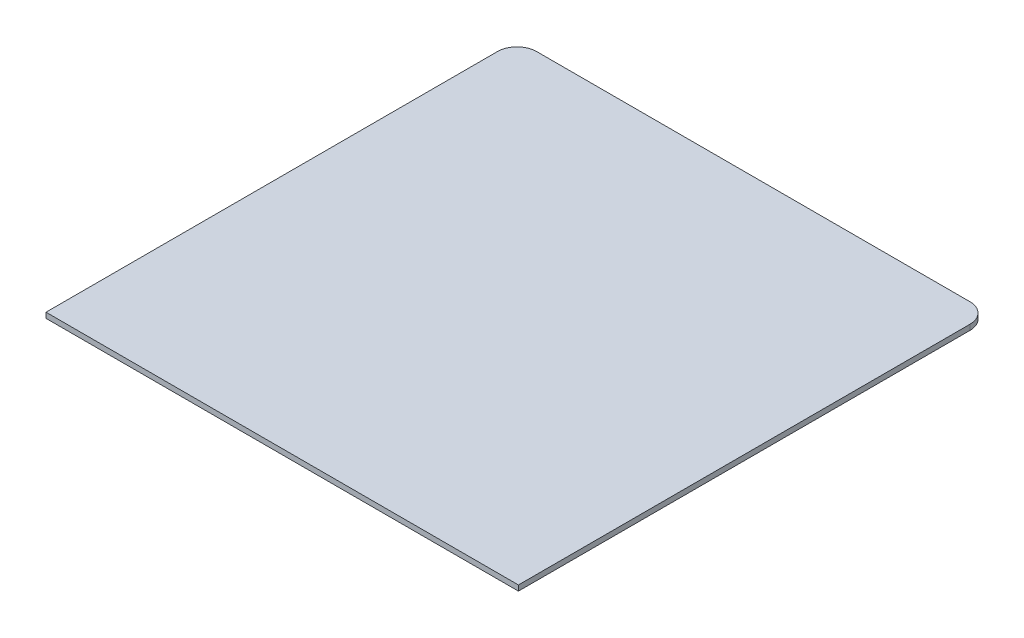
ISO-10303-21;
HEADER;
FILE_DESCRIPTION(('STEP AP214'),'2;1');
FILE_NAME('part.step','',(''),(''),'','','');
FILE_SCHEMA(('AUTOMOTIVE_DESIGN { 1 0 10303 214 1 1 1 1 }'));
ENDSEC;
DATA;
#1=APPLICATION_CONTEXT('core data for automotive mechanical design processes');
#2=APPLICATION_PROTOCOL_DEFINITION('international standard','automotive_design',2000,#1);
#3=PRODUCT_CONTEXT('',#1,'mechanical');
#4=PRODUCT('Part','Part','',(#3));
#5=PRODUCT_RELATED_PRODUCT_CATEGORY('part','',(#4));
#6=PRODUCT_DEFINITION_FORMATION('','',#4);
#7=PRODUCT_DEFINITION_CONTEXT('part definition',#1,'design');
#8=PRODUCT_DEFINITION('design','',#6,#7);
#9=PRODUCT_DEFINITION_SHAPE('','',#8);
#10=(LENGTH_UNIT() NAMED_UNIT(*) SI_UNIT(.MILLI.,.METRE.));
#11=(NAMED_UNIT(*) PLANE_ANGLE_UNIT() SI_UNIT($,.RADIAN.));
#12=(NAMED_UNIT(*) SI_UNIT($,.STERADIAN.) SOLID_ANGLE_UNIT());
#13=UNCERTAINTY_MEASURE_WITH_UNIT(LENGTH_MEASURE(1.E-05),#10,'distance_accuracy_value','');
#14=(GEOMETRIC_REPRESENTATION_CONTEXT(3) GLOBAL_UNCERTAINTY_ASSIGNED_CONTEXT((#13)) GLOBAL_UNIT_ASSIGNED_CONTEXT((#10,
#11,#12)) REPRESENTATION_CONTEXT('',''));
#15=CARTESIAN_POINT('',(0.,0.,0.));
#16=DIRECTION('',(0.,0.,1.));
#17=DIRECTION('',(1.,0.,0.));
#18=AXIS2_PLACEMENT_3D('',#15,#16,#17);
#19=CARTESIAN_POINT('',(0.,110.,0.));
#20=DIRECTION('',(1.,0.,0.));
#21=DIRECTION('',(0.,0.,-1.));
#22=AXIS2_PLACEMENT_3D('',#19,#20,#21);
#23=PLANE('',#22);
#24=DIRECTION('',(0.,0.,1.));
#25=VECTOR('',#24,1.);
#26=CARTESIAN_POINT('',(0.,0.,0.));
#27=LINE('',#26,#25);
#28=CARTESIAN_POINT('',(-1.66533453693773E-13,0.,-9252.));
#29=VERTEX_POINT('',#28);
#30=CARTESIAN_POINT('',(0.,0.,0.));
#31=VERTEX_POINT('',#30);
#32=EDGE_CURVE('E118',#29,#31,#27,.T.);
#33=ORIENTED_EDGE('',*,*,#32,.T.);
#34=DIRECTION('',(0.,-1.,0.));
#35=VECTOR('',#34,1.);
#36=CARTESIAN_POINT('',(0.,110.,0.));
#37=LINE('',#36,#35);
#38=CARTESIAN_POINT('',(0.,110.,0.));
#39=VERTEX_POINT('',#38);
#40=EDGE_CURVE('E11',#39,#31,#37,.T.);
#41=ORIENTED_EDGE('',*,*,#40,.F.);
#42=DIRECTION('',(0.,0.,1.));
#43=VECTOR('',#42,1.);
#44=CARTESIAN_POINT('',(0.,110.,0.));
#45=LINE('',#44,#43);
#46=CARTESIAN_POINT('',(-1.66533453693773E-13,110.,-9252.));
#47=VERTEX_POINT('',#46);
#48=EDGE_CURVE('E128',#47,#39,#45,.T.);
#49=ORIENTED_EDGE('',*,*,#48,.F.);
#50=DIRECTION('',(0.,-1.,0.));
#51=VECTOR('',#50,1.);
#52=CARTESIAN_POINT('',(-1.66533453693773E-13,110.,-9252.));
#53=LINE('',#52,#51);
#54=EDGE_CURVE('E114',#47,#29,#53,.T.);
#55=ORIENTED_EDGE('',*,*,#54,.T.);
#56=EDGE_LOOP('',(#33,#41,#49,#55));
#57=FACE_BOUND('',#56,.T.);
#58=ADVANCED_FACE('F34',(#57),#23,.F.);
#59=CARTESIAN_POINT('',(0.,110.,0.));
#60=DIRECTION('',(0.,0.,-1.));
#61=DIRECTION('',(-1.,0.,0.));
#62=AXIS2_PLACEMENT_3D('',#59,#60,#61);
#63=PLANE('',#62);
#64=DIRECTION('',(1.,0.,0.));
#65=VECTOR('',#64,1.);
#66=CARTESIAN_POINT('',(0.,0.,0.));
#67=LINE('',#66,#65);
#68=CARTESIAN_POINT('',(9680.,0.,0.));
#69=VERTEX_POINT('',#68);
#70=EDGE_CURVE('E121',#31,#69,#67,.T.);
#71=ORIENTED_EDGE('',*,*,#70,.T.);
#72=DIRECTION('',(0.,-1.,0.));
#73=VECTOR('',#72,1.);
#74=CARTESIAN_POINT('',(9680.,110.,0.));
#75=LINE('',#74,#73);
#76=CARTESIAN_POINT('',(9680.,110.,0.));
#77=VERTEX_POINT('',#76);
#78=EDGE_CURVE('E42',#77,#69,#75,.T.);
#79=ORIENTED_EDGE('',*,*,#78,.F.);
#80=DIRECTION('',(1.,0.,0.));
#81=VECTOR('',#80,1.);
#82=CARTESIAN_POINT('',(0.,110.,0.));
#83=LINE('',#82,#81);
#84=EDGE_CURVE('E87',#39,#77,#83,.T.);
#85=ORIENTED_EDGE('',*,*,#84,.F.);
#86=ORIENTED_EDGE('',*,*,#40,.T.);
#87=EDGE_LOOP('',(#71,#79,#85,#86));
#88=FACE_BOUND('',#87,.T.);
#89=ADVANCED_FACE('F152',(#88),#63,.F.);
#90=CARTESIAN_POINT('',(9680.,110.,0.));
#91=DIRECTION('',(-1.,0.,0.));
#92=DIRECTION('',(0.,0.,1.));
#93=AXIS2_PLACEMENT_3D('',#90,#91,#92);
#94=PLANE('',#93);
#95=DIRECTION('',(0.,0.,-1.));
#96=VECTOR('',#95,1.);
#97=CARTESIAN_POINT('',(9680.,0.,0.));
#98=LINE('',#97,#96);
#99=CARTESIAN_POINT('',(9680.,0.,-9252.));
#100=VERTEX_POINT('',#99);
#101=EDGE_CURVE('E123',#69,#100,#98,.T.);
#102=ORIENTED_EDGE('',*,*,#101,.T.);
#103=DIRECTION('',(0.,-1.,0.));
#104=VECTOR('',#103,1.);
#105=CARTESIAN_POINT('',(9680.,110.,-9252.));
#106=LINE('',#105,#104);
#107=CARTESIAN_POINT('',(9680.,110.,-9252.));
#108=VERTEX_POINT('',#107);
#109=EDGE_CURVE('E109',#108,#100,#106,.T.);
#110=ORIENTED_EDGE('',*,*,#109,.F.);
#111=DIRECTION('',(0.,0.,-1.));
#112=VECTOR('',#111,1.);
#113=CARTESIAN_POINT('',(9680.,110.,0.));
#114=LINE('',#113,#112);
#115=EDGE_CURVE('E100',#77,#108,#114,.T.);
#116=ORIENTED_EDGE('',*,*,#115,.F.);
#117=ORIENTED_EDGE('',*,*,#78,.T.);
#118=EDGE_LOOP('',(#102,#110,#116,#117));
#119=FACE_BOUND('',#118,.T.);
#120=ADVANCED_FACE('F134',(#119),#94,.F.);
#121=CARTESIAN_POINT('',(9280.,110.,-9252.));
#122=DIRECTION('',(0.,-1.,0.));
#123=DIRECTION('',(0.,0.,-1.));
#124=AXIS2_PLACEMENT_3D('',#121,#122,#123);
#125=CYLINDRICAL_SURFACE('',#124,400.);
#126=CARTESIAN_POINT('',(9280.,0.,-9252.));
#127=DIRECTION('',(0.,1.,0.));
#128=DIRECTION('',(0.,0.,1.));
#129=AXIS2_PLACEMENT_3D('',#126,#127,#128);
#130=CIRCLE('',#129,400.);
#131=CARTESIAN_POINT('',(9280.,0.,-9652.));
#132=VERTEX_POINT('',#131);
#133=EDGE_CURVE('E108',#100,#132,#130,.T.);
#134=ORIENTED_EDGE('',*,*,#133,.T.);
#135=DIRECTION('',(0.,-1.,0.));
#136=VECTOR('',#135,1.);
#137=CARTESIAN_POINT('',(9280.,110.,-9652.));
#138=LINE('',#137,#136);
#139=CARTESIAN_POINT('',(9280.,110.,-9652.));
#140=VERTEX_POINT('',#139);
#141=EDGE_CURVE('E105',#140,#132,#138,.T.);
#142=ORIENTED_EDGE('',*,*,#141,.F.);
#143=CARTESIAN_POINT('',(9280.,110.,-9252.));
#144=DIRECTION('',(0.,1.,0.));
#145=DIRECTION('',(0.,0.,1.));
#146=AXIS2_PLACEMENT_3D('',#143,#144,#145);
#147=CIRCLE('',#146,400.);
#148=EDGE_CURVE('E94',#108,#140,#147,.T.);
#149=ORIENTED_EDGE('',*,*,#148,.F.);
#150=ORIENTED_EDGE('',*,*,#109,.T.);
#151=EDGE_LOOP('',(#134,#142,#149,#150));
#152=FACE_BOUND('',#151,.T.);
#153=ADVANCED_FACE('F106',(#152),#125,.T.);
#154=CARTESIAN_POINT('',(9280.,110.,-9652.));
#155=DIRECTION('',(0.,0.,1.));
#156=DIRECTION('',(1.,0.,0.));
#157=AXIS2_PLACEMENT_3D('',#154,#155,#156);
#158=PLANE('',#157);
#159=DIRECTION('',(-1.,0.,0.));
#160=VECTOR('',#159,1.);
#161=CARTESIAN_POINT('',(9280.,0.,-9652.));
#162=LINE('',#161,#160);
#163=CARTESIAN_POINT('',(400.,0.,-9652.));
#164=VERTEX_POINT('',#163);
#165=EDGE_CURVE('E73',#132,#164,#162,.T.);
#166=ORIENTED_EDGE('',*,*,#165,.T.);
#167=DIRECTION('',(0.,-1.,0.));
#168=VECTOR('',#167,1.);
#169=CARTESIAN_POINT('',(400.,110.,-9652.));
#170=LINE('',#169,#168);
#171=CARTESIAN_POINT('',(400.,110.,-9652.));
#172=VERTEX_POINT('',#171);
#173=EDGE_CURVE('E110',#172,#164,#170,.T.);
#174=ORIENTED_EDGE('',*,*,#173,.F.);
#175=DIRECTION('',(-1.,0.,0.));
#176=VECTOR('',#175,1.);
#177=CARTESIAN_POINT('',(9280.,110.,-9652.));
#178=LINE('',#177,#176);
#179=EDGE_CURVE('E98',#140,#172,#178,.T.);
#180=ORIENTED_EDGE('',*,*,#179,.F.);
#181=ORIENTED_EDGE('',*,*,#141,.T.);
#182=EDGE_LOOP('',(#166,#174,#180,#181));
#183=FACE_BOUND('',#182,.T.);
#184=ADVANCED_FACE('F112',(#183),#158,.F.);
#185=CARTESIAN_POINT('',(400.,110.,-9252.));
#186=DIRECTION('',(0.,-1.,0.));
#187=DIRECTION('',(0.,0.,-1.));
#188=AXIS2_PLACEMENT_3D('',#185,#186,#187);
#189=CYLINDRICAL_SURFACE('',#188,400.);
#190=CARTESIAN_POINT('',(400.,0.,-9252.));
#191=DIRECTION('',(0.,1.,0.));
#192=DIRECTION('',(0.,0.,-1.));
#193=AXIS2_PLACEMENT_3D('',#190,#191,#192);
#194=CIRCLE('',#193,400.);
#195=EDGE_CURVE('E79',#164,#29,#194,.T.);
#196=ORIENTED_EDGE('',*,*,#195,.T.);
#197=ORIENTED_EDGE('',*,*,#54,.F.);
#198=CARTESIAN_POINT('',(400.,110.,-9252.));
#199=DIRECTION('',(0.,1.,0.));
#200=DIRECTION('',(0.,0.,-1.));
#201=AXIS2_PLACEMENT_3D('',#198,#199,#200);
#202=CIRCLE('',#201,400.);
#203=EDGE_CURVE('E50',#172,#47,#202,.T.);
#204=ORIENTED_EDGE('',*,*,#203,.F.);
#205=ORIENTED_EDGE('',*,*,#173,.T.);
#206=EDGE_LOOP('',(#196,#197,#204,#205));
#207=FACE_BOUND('',#206,.T.);
#208=ADVANCED_FACE('F141',(#207),#189,.T.);
#209=CARTESIAN_POINT('',(400.,110.,-9252.));
#210=DIRECTION('',(0.,-1.,0.));
#211=DIRECTION('',(0.,0.,-1.));
#212=AXIS2_PLACEMENT_3D('',#209,#210,#211);
#213=PLANE('',#212);
#214=ORIENTED_EDGE('',*,*,#48,.T.);
#215=ORIENTED_EDGE('',*,*,#84,.T.);
#216=ORIENTED_EDGE('',*,*,#115,.T.);
#217=ORIENTED_EDGE('',*,*,#148,.T.);
#218=ORIENTED_EDGE('',*,*,#179,.T.);
#219=ORIENTED_EDGE('',*,*,#203,.T.);
#220=EDGE_LOOP('',(#214,#215,#216,#217,#218,#219));
#221=FACE_BOUND('',#220,.T.);
#222=ADVANCED_FACE('F96',(#221),#213,.F.);
#223=CARTESIAN_POINT('',(400.,0.,-9252.));
#224=DIRECTION('',(0.,-1.,0.));
#225=DIRECTION('',(0.,0.,-1.));
#226=AXIS2_PLACEMENT_3D('',#223,#224,#225);
#227=PLANE('',#226);
#228=ORIENTED_EDGE('',*,*,#32,.F.);
#229=ORIENTED_EDGE('',*,*,#195,.F.);
#230=ORIENTED_EDGE('',*,*,#165,.F.);
#231=ORIENTED_EDGE('',*,*,#133,.F.);
#232=ORIENTED_EDGE('',*,*,#101,.F.);
#233=ORIENTED_EDGE('',*,*,#70,.F.);
#234=EDGE_LOOP('',(#228,#229,#230,#231,#232,#233));
#235=FACE_BOUND('',#234,.T.);
#236=ADVANCED_FACE('F137',(#235),#227,.T.);
#237=CLOSED_SHELL('',(#58,#89,#120,#153,#184,#208,#222,#236));
#238=MANIFOLD_SOLID_BREP('B2',#237);
#239=ADVANCED_BREP_SHAPE_REPRESENTATION('',(#18,#238),#14);
#240=SHAPE_DEFINITION_REPRESENTATION(#9,#239);
ENDSEC;
END-ISO-10303-21;
